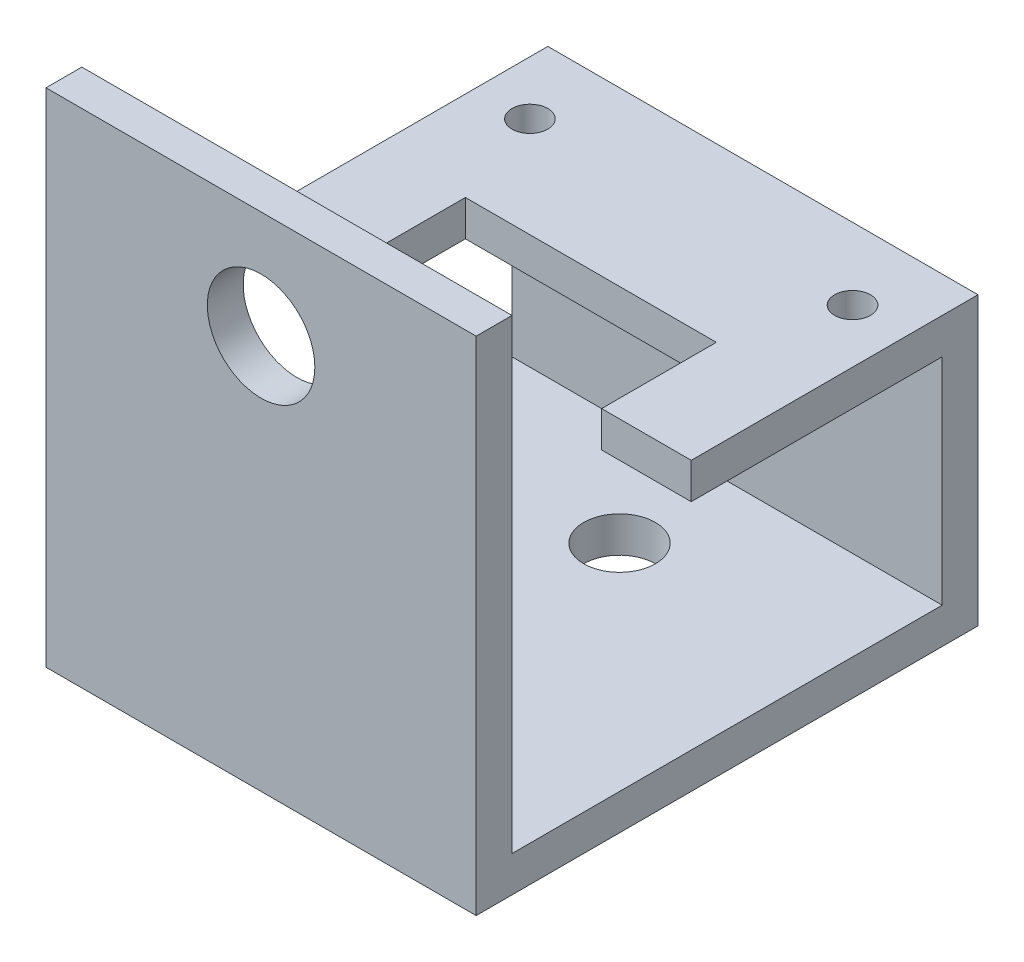
ISO-10303-21;
HEADER;
FILE_DESCRIPTION(('STEP AP214'),'2;1');
FILE_NAME('part.step','',(''),(''),'','','');
FILE_SCHEMA(('AUTOMOTIVE_DESIGN { 1 0 10303 214 1 1 1 1 }'));
ENDSEC;
DATA;
#1=APPLICATION_CONTEXT('core data for automotive mechanical design processes');
#2=APPLICATION_PROTOCOL_DEFINITION('international standard','automotive_design',2000,#1);
#3=PRODUCT_CONTEXT('',#1,'mechanical');
#4=PRODUCT('Part','Part','',(#3));
#5=PRODUCT_RELATED_PRODUCT_CATEGORY('part','',(#4));
#6=PRODUCT_DEFINITION_FORMATION('','',#4);
#7=PRODUCT_DEFINITION_CONTEXT('part definition',#1,'design');
#8=PRODUCT_DEFINITION('design','',#6,#7);
#9=PRODUCT_DEFINITION_SHAPE('','',#8);
#10=(LENGTH_UNIT() NAMED_UNIT(*) SI_UNIT(.MILLI.,.METRE.));
#11=(NAMED_UNIT(*) PLANE_ANGLE_UNIT() SI_UNIT($,.RADIAN.));
#12=(NAMED_UNIT(*) SI_UNIT($,.STERADIAN.) SOLID_ANGLE_UNIT());
#13=UNCERTAINTY_MEASURE_WITH_UNIT(LENGTH_MEASURE(1.E-05),#10,'distance_accuracy_value','');
#14=(GEOMETRIC_REPRESENTATION_CONTEXT(3) GLOBAL_UNCERTAINTY_ASSIGNED_CONTEXT((#13)) GLOBAL_UNIT_ASSIGNED_CONTEXT((#10,
#11,#12)) REPRESENTATION_CONTEXT('',''));
#15=CARTESIAN_POINT('',(0.,0.,0.));
#16=DIRECTION('',(0.,0.,1.));
#17=DIRECTION('',(1.,0.,0.));
#18=AXIS2_PLACEMENT_3D('',#15,#16,#17);
#19=CARTESIAN_POINT('',(38.1,0.,0.));
#20=DIRECTION('',(0.,-1.,0.));
#21=DIRECTION('',(0.,0.,-1.));
#22=AXIS2_PLACEMENT_3D('',#19,#20,#21);
#23=PLANE('',#22);
#24=DIRECTION('',(0.,0.,1.));
#25=VECTOR('',#24,1.);
#26=CARTESIAN_POINT('',(0.,0.,0.));
#27=LINE('',#26,#25);
#28=CARTESIAN_POINT('',(0.,0.,0.));
#29=VERTEX_POINT('',#28);
#30=CARTESIAN_POINT('',(0.,0.,38.1));
#31=VERTEX_POINT('',#30);
#32=EDGE_CURVE('E160',#29,#31,#27,.T.);
#33=ORIENTED_EDGE('',*,*,#32,.T.);
#34=DIRECTION('',(-1.,0.,0.));
#35=VECTOR('',#34,1.);
#36=CARTESIAN_POINT('',(38.1,0.,38.1));
#37=LINE('',#36,#35);
#38=CARTESIAN_POINT('',(38.1,0.,38.1));
#39=VERTEX_POINT('',#38);
#40=EDGE_CURVE('E40',#39,#31,#37,.T.);
#41=ORIENTED_EDGE('',*,*,#40,.F.);
#42=DIRECTION('',(0.,0.,1.));
#43=VECTOR('',#42,1.);
#44=CARTESIAN_POINT('',(38.1,0.,0.));
#45=LINE('',#44,#43);
#46=CARTESIAN_POINT('',(38.1,0.,0.));
#47=VERTEX_POINT('',#46);
#48=EDGE_CURVE('E102',#47,#39,#45,.T.);
#49=ORIENTED_EDGE('',*,*,#48,.F.);
#50=DIRECTION('',(-1.,0.,0.));
#51=VECTOR('',#50,1.);
#52=CARTESIAN_POINT('',(38.1,0.,0.));
#53=LINE('',#52,#51);
#54=EDGE_CURVE('E11',#47,#29,#53,.T.);
#55=ORIENTED_EDGE('',*,*,#54,.T.);
#56=EDGE_LOOP('',(#33,#41,#49,#55));
#57=FACE_BOUND('',#56,.T.);
#58=CARTESIAN_POINT('',(19.05,0.,9.52499999999999));
#59=DIRECTION('',(0.,-1.,0.));
#60=DIRECTION('',(0.,0.,-1.));
#61=AXIS2_PLACEMENT_3D('',#58,#59,#60);
#62=CIRCLE('',#61,3.17499999999999);
#63=CARTESIAN_POINT('',(19.05,0.,6.35));
#64=VERTEX_POINT('',#63);
#65=EDGE_CURVE('E268',#64,#64,#62,.F.);
#66=ORIENTED_EDGE('',*,*,#65,.F.);
#67=EDGE_LOOP('',(#66));
#68=FACE_BOUND('',#67,.T.);
#69=CARTESIAN_POINT('',(19.05,0.,28.575));
#70=DIRECTION('',(0.,-1.,0.));
#71=DIRECTION('',(0.,0.,-1.));
#72=AXIS2_PLACEMENT_3D('',#69,#70,#71);
#73=CIRCLE('',#72,3.17499999999999);
#74=CARTESIAN_POINT('',(19.05,0.,25.4));
#75=VERTEX_POINT('',#74);
#76=EDGE_CURVE('E272',#75,#75,#73,.F.);
#77=ORIENTED_EDGE('',*,*,#76,.F.);
#78=EDGE_LOOP('',(#77));
#79=FACE_BOUND('',#78,.T.);
#80=ADVANCED_FACE('F32',(#57,#68,#79),#23,.F.);
#81=CARTESIAN_POINT('',(38.1,22.225,22.225));
#82=DIRECTION('',(0.,0.,-1.));
#83=DIRECTION('',(0.,1.,0.));
#84=AXIS2_PLACEMENT_3D('',#81,#82,#83);
#85=PLANE('',#84);
#86=DIRECTION('',(-1.,0.,0.));
#87=VECTOR('',#86,1.);
#88=CARTESIAN_POINT('',(38.1,22.225,22.225));
#89=LINE('',#88,#87);
#90=CARTESIAN_POINT('',(38.1,22.225,22.225));
#91=VERTEX_POINT('',#90);
#92=CARTESIAN_POINT('',(30.1625,22.225,22.225));
#93=VERTEX_POINT('',#92);
#94=EDGE_CURVE('E138',#91,#93,#89,.T.);
#95=ORIENTED_EDGE('',*,*,#94,.T.);
#96=DIRECTION('',(0.,1.,0.));
#97=VECTOR('',#96,1.);
#98=CARTESIAN_POINT('',(30.1625,-5.38718938421521,22.225));
#99=LINE('',#98,#97);
#100=CARTESIAN_POINT('',(30.1625,19.05,22.225));
#101=VERTEX_POINT('',#100);
#102=EDGE_CURVE('E238',#101,#93,#99,.T.);
#103=ORIENTED_EDGE('',*,*,#102,.F.);
#104=DIRECTION('',(-1.,0.,0.));
#105=VECTOR('',#104,1.);
#106=CARTESIAN_POINT('',(38.1,19.05,22.225));
#107=LINE('',#106,#105);
#108=CARTESIAN_POINT('',(38.1,19.05,22.225));
#109=VERTEX_POINT('',#108);
#110=EDGE_CURVE('E151',#109,#101,#107,.T.);
#111=ORIENTED_EDGE('',*,*,#110,.F.);
#112=DIRECTION('',(0.,-1.,0.));
#113=VECTOR('',#112,1.);
#114=CARTESIAN_POINT('',(38.1,22.225,22.225));
#115=LINE('',#114,#113);
#116=EDGE_CURVE('E128',#91,#109,#115,.T.);
#117=ORIENTED_EDGE('',*,*,#116,.F.);
#118=EDGE_LOOP('',(#95,#103,#111,#117));
#119=FACE_BOUND('',#118,.T.);
#120=ADVANCED_FACE('F149',(#119),#85,.F.);
#121=CARTESIAN_POINT('',(38.1,19.05,0.));
#122=DIRECTION('',(0.,0.,-1.));
#123=DIRECTION('',(-1.,0.,0.));
#124=AXIS2_PLACEMENT_3D('',#121,#122,#123);
#125=PLANE('',#124);
#126=DIRECTION('',(0.,-1.,0.));
#127=VECTOR('',#126,1.);
#128=CARTESIAN_POINT('',(0.,19.05,0.));
#129=LINE('',#128,#127);
#130=CARTESIAN_POINT('',(0.,19.05,0.));
#131=VERTEX_POINT('',#130);
#132=EDGE_CURVE('E157',#131,#29,#129,.T.);
#133=ORIENTED_EDGE('',*,*,#132,.T.);
#134=ORIENTED_EDGE('',*,*,#54,.F.);
#135=DIRECTION('',(0.,-1.,0.));
#136=VECTOR('',#135,1.);
#137=CARTESIAN_POINT('',(38.1,19.05,0.));
#138=LINE('',#137,#136);
#139=CARTESIAN_POINT('',(38.1,19.05,0.));
#140=VERTEX_POINT('',#139);
#141=EDGE_CURVE('E180',#140,#47,#138,.T.);
#142=ORIENTED_EDGE('',*,*,#141,.F.);
#143=DIRECTION('',(-1.,0.,0.));
#144=VECTOR('',#143,1.);
#145=CARTESIAN_POINT('',(38.1,19.05,0.));
#146=LINE('',#145,#144);
#147=EDGE_CURVE('E153',#140,#131,#146,.T.);
#148=ORIENTED_EDGE('',*,*,#147,.T.);
#149=EDGE_LOOP('',(#133,#134,#142,#148));
#150=FACE_BOUND('',#149,.T.);
#151=ADVANCED_FACE('F34',(#150),#125,.F.);
#152=CARTESIAN_POINT('',(38.1,0.,38.1));
#153=DIRECTION('',(0.,0.,1.));
#154=DIRECTION('',(1.,0.,0.));
#155=AXIS2_PLACEMENT_3D('',#152,#153,#154);
#156=PLANE('',#155);
#157=CARTESIAN_POINT('',(19.05,31.75,38.1));
#158=DIRECTION('',(0.,0.,1.));
#159=DIRECTION('',(1.,0.,0.));
#160=AXIS2_PLACEMENT_3D('',#157,#158,#159);
#161=CIRCLE('',#160,4.7625);
#162=CARTESIAN_POINT('',(23.8125,31.75,38.1));
#163=VERTEX_POINT('',#162);
#164=EDGE_CURVE('E262',#163,#163,#161,.F.);
#165=ORIENTED_EDGE('',*,*,#164,.F.);
#166=EDGE_LOOP('',(#165));
#167=FACE_BOUND('',#166,.T.);
#168=DIRECTION('',(0.,1.,0.));
#169=VECTOR('',#168,1.);
#170=CARTESIAN_POINT('',(0.,0.,38.1));
#171=LINE('',#170,#169);
#172=CARTESIAN_POINT('',(0.,41.275,38.1));
#173=VERTEX_POINT('',#172);
#174=EDGE_CURVE('E163',#31,#173,#171,.T.);
#175=ORIENTED_EDGE('',*,*,#174,.T.);
#176=DIRECTION('',(-1.,0.,0.));
#177=VECTOR('',#176,1.);
#178=CARTESIAN_POINT('',(38.1,41.275,38.1));
#179=LINE('',#178,#177);
#180=CARTESIAN_POINT('',(38.1,41.275,38.1));
#181=VERTEX_POINT('',#180);
#182=EDGE_CURVE('E194',#181,#173,#179,.T.);
#183=ORIENTED_EDGE('',*,*,#182,.F.);
#184=DIRECTION('',(0.,1.,0.));
#185=VECTOR('',#184,1.);
#186=CARTESIAN_POINT('',(38.1,0.,38.1));
#187=LINE('',#186,#185);
#188=EDGE_CURVE('E202',#39,#181,#187,.T.);
#189=ORIENTED_EDGE('',*,*,#188,.F.);
#190=ORIENTED_EDGE('',*,*,#40,.T.);
#191=EDGE_LOOP('',(#175,#183,#189,#190));
#192=FACE_BOUND('',#191,.T.);
#193=ADVANCED_FACE('F200',(#167,#192),#156,.F.);
#194=CARTESIAN_POINT('',(38.1,41.275,41.275));
#195=DIRECTION('',(0.,-1.,0.));
#196=DIRECTION('',(0.,0.,-1.));
#197=AXIS2_PLACEMENT_3D('',#194,#195,#196);
#198=PLANE('',#197);
#199=DIRECTION('',(0.,0.,1.));
#200=VECTOR('',#199,1.);
#201=CARTESIAN_POINT('',(0.,41.275,41.275));
#202=LINE('',#201,#200);
#203=CARTESIAN_POINT('',(0.,41.275,41.275));
#204=VERTEX_POINT('',#203);
#205=EDGE_CURVE('E165',#173,#204,#202,.T.);
#206=ORIENTED_EDGE('',*,*,#205,.T.);
#207=DIRECTION('',(-1.,0.,0.));
#208=VECTOR('',#207,1.);
#209=CARTESIAN_POINT('',(38.1,41.275,41.275));
#210=LINE('',#209,#208);
#211=CARTESIAN_POINT('',(38.1,41.275,41.275));
#212=VERTEX_POINT('',#211);
#213=EDGE_CURVE('E191',#212,#204,#210,.T.);
#214=ORIENTED_EDGE('',*,*,#213,.F.);
#215=DIRECTION('',(0.,0.,1.));
#216=VECTOR('',#215,1.);
#217=CARTESIAN_POINT('',(38.1,41.275,41.275));
#218=LINE('',#217,#216);
#219=EDGE_CURVE('E220',#181,#212,#218,.T.);
#220=ORIENTED_EDGE('',*,*,#219,.F.);
#221=ORIENTED_EDGE('',*,*,#182,.T.);
#222=EDGE_LOOP('',(#206,#214,#220,#221));
#223=FACE_BOUND('',#222,.T.);
#224=ADVANCED_FACE('F211',(#223),#198,.F.);
#225=CARTESIAN_POINT('',(38.1,41.275,41.275));
#226=DIRECTION('',(0.,0.,-1.));
#227=DIRECTION('',(-1.,0.,0.));
#228=AXIS2_PLACEMENT_3D('',#225,#226,#227);
#229=PLANE('',#228);
#230=CARTESIAN_POINT('',(19.05,31.75,41.275));
#231=DIRECTION('',(0.,0.,1.));
#232=DIRECTION('',(1.,0.,0.));
#233=AXIS2_PLACEMENT_3D('',#230,#231,#232);
#234=CIRCLE('',#233,4.7625);
#235=CARTESIAN_POINT('',(23.8125,31.75,41.275));
#236=VERTEX_POINT('',#235);
#237=EDGE_CURVE('E265',#236,#236,#234,.T.);
#238=ORIENTED_EDGE('',*,*,#237,.F.);
#239=EDGE_LOOP('',(#238));
#240=FACE_BOUND('',#239,.T.);
#241=DIRECTION('',(0.,-1.,0.));
#242=VECTOR('',#241,1.);
#243=CARTESIAN_POINT('',(0.,41.275,41.275));
#244=LINE('',#243,#242);
#245=CARTESIAN_POINT('',(0.,-3.17500000000001,41.275));
#246=VERTEX_POINT('',#245);
#247=EDGE_CURVE('E167',#204,#246,#244,.T.);
#248=ORIENTED_EDGE('',*,*,#247,.T.);
#249=DIRECTION('',(-1.,0.,0.));
#250=VECTOR('',#249,1.);
#251=CARTESIAN_POINT('',(38.1,-3.17500000000001,41.275));
#252=LINE('',#251,#250);
#253=CARTESIAN_POINT('',(38.1,-3.17500000000001,41.275));
#254=VERTEX_POINT('',#253);
#255=EDGE_CURVE('E188',#254,#246,#252,.T.);
#256=ORIENTED_EDGE('',*,*,#255,.F.);
#257=DIRECTION('',(0.,-1.,0.));
#258=VECTOR('',#257,1.);
#259=CARTESIAN_POINT('',(38.1,41.275,41.275));
#260=LINE('',#259,#258);
#261=EDGE_CURVE('E217',#212,#254,#260,.T.);
#262=ORIENTED_EDGE('',*,*,#261,.F.);
#263=ORIENTED_EDGE('',*,*,#213,.T.);
#264=EDGE_LOOP('',(#248,#256,#262,#263));
#265=FACE_BOUND('',#264,.T.);
#266=ADVANCED_FACE('F215',(#240,#265),#229,.F.);
#267=CARTESIAN_POINT('',(38.1,-3.17500000000001,41.275));
#268=DIRECTION('',(0.,1.,0.));
#269=DIRECTION('',(0.,0.,1.));
#270=AXIS2_PLACEMENT_3D('',#267,#268,#269);
#271=PLANE('',#270);
#272=CARTESIAN_POINT('',(19.05,-3.17500000000001,28.575));
#273=DIRECTION('',(0.,-1.,0.));
#274=DIRECTION('',(0.,0.,-1.));
#275=AXIS2_PLACEMENT_3D('',#272,#273,#274);
#276=CIRCLE('',#275,3.17499999999999);
#277=CARTESIAN_POINT('',(19.05,-3.17500000000001,25.4));
#278=VERTEX_POINT('',#277);
#279=EDGE_CURVE('E275',#278,#278,#276,.T.);
#280=ORIENTED_EDGE('',*,*,#279,.F.);
#281=EDGE_LOOP('',(#280));
#282=FACE_BOUND('',#281,.T.);
#283=CARTESIAN_POINT('',(19.05,-3.17500000000001,9.52499999999999));
#284=DIRECTION('',(0.,-1.,0.));
#285=DIRECTION('',(0.,0.,-1.));
#286=AXIS2_PLACEMENT_3D('',#283,#284,#285);
#287=CIRCLE('',#286,3.17499999999999);
#288=CARTESIAN_POINT('',(19.05,-3.17500000000001,6.35));
#289=VERTEX_POINT('',#288);
#290=EDGE_CURVE('E269',#289,#289,#287,.T.);
#291=ORIENTED_EDGE('',*,*,#290,.F.);
#292=EDGE_LOOP('',(#291));
#293=FACE_BOUND('',#292,.T.);
#294=DIRECTION('',(0.,0.,-1.));
#295=VECTOR('',#294,1.);
#296=CARTESIAN_POINT('',(0.,-3.17500000000001,41.275));
#297=LINE('',#296,#295);
#298=CARTESIAN_POINT('',(0.,-3.175,-3.175));
#299=VERTEX_POINT('',#298);
#300=EDGE_CURVE('E169',#246,#299,#297,.T.);
#301=ORIENTED_EDGE('',*,*,#300,.T.);
#302=DIRECTION('',(-1.,0.,0.));
#303=VECTOR('',#302,1.);
#304=CARTESIAN_POINT('',(38.1,-3.175,-3.175));
#305=LINE('',#304,#303);
#306=CARTESIAN_POINT('',(38.1,-3.175,-3.175));
#307=VERTEX_POINT('',#306);
#308=EDGE_CURVE('E185',#307,#299,#305,.T.);
#309=ORIENTED_EDGE('',*,*,#308,.F.);
#310=DIRECTION('',(0.,0.,-1.));
#311=VECTOR('',#310,1.);
#312=CARTESIAN_POINT('',(38.1,-3.17500000000001,41.275));
#313=LINE('',#312,#311);
#314=EDGE_CURVE('E219',#254,#307,#313,.T.);
#315=ORIENTED_EDGE('',*,*,#314,.F.);
#316=ORIENTED_EDGE('',*,*,#255,.T.);
#317=EDGE_LOOP('',(#301,#309,#315,#316));
#318=FACE_BOUND('',#317,.T.);
#319=ADVANCED_FACE('F299',(#282,#293,#318),#271,.F.);
#320=CARTESIAN_POINT('',(38.1,-3.175,-3.175));
#321=DIRECTION('',(0.,0.,1.));
#322=DIRECTION('',(0.,-1.,0.));
#323=AXIS2_PLACEMENT_3D('',#320,#321,#322);
#324=PLANE('',#323);
#325=DIRECTION('',(0.,1.,0.));
#326=VECTOR('',#325,1.);
#327=CARTESIAN_POINT('',(0.,-3.175,-3.175));
#328=LINE('',#327,#326);
#329=CARTESIAN_POINT('',(0.,22.225,-3.175));
#330=VERTEX_POINT('',#329);
#331=EDGE_CURVE('E171',#299,#330,#328,.T.);
#332=ORIENTED_EDGE('',*,*,#331,.T.);
#333=DIRECTION('',(-1.,0.,0.));
#334=VECTOR('',#333,1.);
#335=CARTESIAN_POINT('',(38.1,22.225,-3.175));
#336=LINE('',#335,#334);
#337=CARTESIAN_POINT('',(38.1,22.225,-3.175));
#338=VERTEX_POINT('',#337);
#339=EDGE_CURVE('E146',#338,#330,#336,.T.);
#340=ORIENTED_EDGE('',*,*,#339,.F.);
#341=DIRECTION('',(0.,1.,0.));
#342=VECTOR('',#341,1.);
#343=CARTESIAN_POINT('',(38.1,-3.175,-3.175));
#344=LINE('',#343,#342);
#345=EDGE_CURVE('E131',#307,#338,#344,.T.);
#346=ORIENTED_EDGE('',*,*,#345,.F.);
#347=ORIENTED_EDGE('',*,*,#308,.T.);
#348=EDGE_LOOP('',(#332,#340,#346,#347));
#349=FACE_BOUND('',#348,.T.);
#350=ADVANCED_FACE('F303',(#349),#324,.F.);
#351=CARTESIAN_POINT('',(38.1,22.225,-3.175));
#352=DIRECTION('',(0.,-1.,0.));
#353=DIRECTION('',(0.,0.,-1.));
#354=AXIS2_PLACEMENT_3D('',#351,#352,#353);
#355=PLANE('',#354);
#356=CARTESIAN_POINT('',(4.7625,22.225,3.17499999999999));
#357=DIRECTION('',(0.,1.,0.));
#358=DIRECTION('',(0.,0.,1.));
#359=AXIS2_PLACEMENT_3D('',#356,#357,#358);
#360=CIRCLE('',#359,1.5875);
#361=CARTESIAN_POINT('',(4.7625,22.225,4.76249999999999));
#362=VERTEX_POINT('',#361);
#363=EDGE_CURVE('E259',#362,#362,#360,.T.);
#364=ORIENTED_EDGE('',*,*,#363,.F.);
#365=EDGE_LOOP('',(#364));
#366=FACE_BOUND('',#365,.T.);
#367=CARTESIAN_POINT('',(33.3375,22.225,3.17499999999999));
#368=DIRECTION('',(0.,1.,0.));
#369=DIRECTION('',(0.,0.,1.));
#370=AXIS2_PLACEMENT_3D('',#367,#368,#369);
#371=CIRCLE('',#370,1.5875);
#372=CARTESIAN_POINT('',(33.3375,22.225,4.76249999999999));
#373=VERTEX_POINT('',#372);
#374=EDGE_CURVE('E253',#373,#373,#371,.T.);
#375=ORIENTED_EDGE('',*,*,#374,.F.);
#376=EDGE_LOOP('',(#375));
#377=FACE_BOUND('',#376,.T.);
#378=DIRECTION('',(-1.,0.,0.));
#379=VECTOR('',#378,1.);
#380=CARTESIAN_POINT('',(30.1625,22.225,12.065));
#381=LINE('',#380,#379);
#382=CARTESIAN_POINT('',(30.1625,22.225,12.065));
#383=VERTEX_POINT('',#382);
#384=CARTESIAN_POINT('',(7.9375,22.225,12.065));
#385=VERTEX_POINT('',#384);
#386=EDGE_CURVE('E244',#383,#385,#381,.T.);
#387=ORIENTED_EDGE('',*,*,#386,.F.);
#388=DIRECTION('',(0.,0.,-1.));
#389=VECTOR('',#388,1.);
#390=CARTESIAN_POINT('',(30.1625,22.225,22.225));
#391=LINE('',#390,#389);
#392=EDGE_CURVE('E143',#93,#383,#391,.T.);
#393=ORIENTED_EDGE('',*,*,#392,.F.);
#394=ORIENTED_EDGE('',*,*,#94,.F.);
#395=DIRECTION('',(0.,0.,1.));
#396=VECTOR('',#395,1.);
#397=CARTESIAN_POINT('',(38.1,22.225,-3.175));
#398=LINE('',#397,#396);
#399=EDGE_CURVE('E124',#338,#91,#398,.T.);
#400=ORIENTED_EDGE('',*,*,#399,.F.);
#401=ORIENTED_EDGE('',*,*,#339,.T.);
#402=DIRECTION('',(0.,0.,1.));
#403=VECTOR('',#402,1.);
#404=CARTESIAN_POINT('',(0.,22.225,-3.175));
#405=LINE('',#404,#403);
#406=CARTESIAN_POINT('',(0.,22.225,22.225));
#407=VERTEX_POINT('',#406);
#408=EDGE_CURVE('E173',#330,#407,#405,.T.);
#409=ORIENTED_EDGE('',*,*,#408,.T.);
#410=CARTESIAN_POINT('',(7.9375,22.225,22.225));
#411=VERTEX_POINT('',#410);
#412=EDGE_CURVE('E147',#411,#407,#89,.T.);
#413=ORIENTED_EDGE('',*,*,#412,.F.);
#414=DIRECTION('',(0.,0.,1.));
#415=VECTOR('',#414,1.);
#416=CARTESIAN_POINT('',(7.9375,22.225,22.225));
#417=LINE('',#416,#415);
#418=EDGE_CURVE('E233',#385,#411,#417,.T.);
#419=ORIENTED_EDGE('',*,*,#418,.F.);
#420=EDGE_LOOP('',(#387,#393,#394,#400,#401,#409,#413,#419));
#421=FACE_BOUND('',#420,.T.);
#422=ADVANCED_FACE('F140',(#366,#377,#421),#355,.F.);
#423=CARTESIAN_POINT('',(7.9375,19.05,22.225));
#424=VERTEX_POINT('',#423);
#425=CARTESIAN_POINT('',(0.,19.05,22.225));
#426=VERTEX_POINT('',#425);
#427=EDGE_CURVE('E182',#424,#426,#107,.T.);
#428=ORIENTED_EDGE('',*,*,#427,.F.);
#429=DIRECTION('',(0.,1.,0.));
#430=VECTOR('',#429,1.);
#431=CARTESIAN_POINT('',(7.9375,-5.38718938421521,22.225));
#432=LINE('',#431,#430);
#433=EDGE_CURVE('E235',#424,#411,#432,.T.);
#434=ORIENTED_EDGE('',*,*,#433,.T.);
#435=ORIENTED_EDGE('',*,*,#412,.T.);
#436=DIRECTION('',(0.,-1.,0.));
#437=VECTOR('',#436,1.);
#438=CARTESIAN_POINT('',(0.,22.225,22.225));
#439=LINE('',#438,#437);
#440=EDGE_CURVE('E176',#407,#426,#439,.T.);
#441=ORIENTED_EDGE('',*,*,#440,.T.);
#442=EDGE_LOOP('',(#428,#434,#435,#441));
#443=FACE_BOUND('',#442,.T.);
#444=ADVANCED_FACE('F289',(#443),#85,.F.);
#445=CARTESIAN_POINT('',(38.1,19.05,22.225));
#446=DIRECTION('',(0.,1.,0.));
#447=DIRECTION('',(0.,0.,1.));
#448=AXIS2_PLACEMENT_3D('',#445,#446,#447);
#449=PLANE('',#448);
#450=CARTESIAN_POINT('',(4.7625,19.05,3.17499999999999));
#451=DIRECTION('',(0.,1.,0.));
#452=DIRECTION('',(0.,0.,1.));
#453=AXIS2_PLACEMENT_3D('',#450,#451,#452);
#454=CIRCLE('',#453,1.5875);
#455=CARTESIAN_POINT('',(4.7625,19.05,4.76249999999999));
#456=VERTEX_POINT('',#455);
#457=EDGE_CURVE('E256',#456,#456,#454,.F.);
#458=ORIENTED_EDGE('',*,*,#457,.F.);
#459=EDGE_LOOP('',(#458));
#460=FACE_BOUND('',#459,.T.);
#461=CARTESIAN_POINT('',(33.3375,19.05,3.17499999999999));
#462=DIRECTION('',(0.,1.,0.));
#463=DIRECTION('',(0.,0.,1.));
#464=AXIS2_PLACEMENT_3D('',#461,#462,#463);
#465=CIRCLE('',#464,1.5875);
#466=CARTESIAN_POINT('',(33.3375,19.05,4.76249999999999));
#467=VERTEX_POINT('',#466);
#468=EDGE_CURVE('E247',#467,#467,#465,.F.);
#469=ORIENTED_EDGE('',*,*,#468,.F.);
#470=EDGE_LOOP('',(#469));
#471=FACE_BOUND('',#470,.T.);
#472=ORIENTED_EDGE('',*,*,#110,.T.);
#473=DIRECTION('',(0.,0.,1.));
#474=VECTOR('',#473,1.);
#475=CARTESIAN_POINT('',(30.1625,19.05,22.225));
#476=LINE('',#475,#474);
#477=CARTESIAN_POINT('',(30.1625,19.05,12.065));
#478=VERTEX_POINT('',#477);
#479=EDGE_CURVE('E229',#478,#101,#476,.T.);
#480=ORIENTED_EDGE('',*,*,#479,.F.);
#481=DIRECTION('',(1.,0.,0.));
#482=VECTOR('',#481,1.);
#483=CARTESIAN_POINT('',(30.1625,19.05,12.065));
#484=LINE('',#483,#482);
#485=CARTESIAN_POINT('',(7.9375,19.05,12.065));
#486=VERTEX_POINT('',#485);
#487=EDGE_CURVE('E161',#486,#478,#484,.T.);
#488=ORIENTED_EDGE('',*,*,#487,.F.);
#489=DIRECTION('',(0.,0.,-1.));
#490=VECTOR('',#489,1.);
#491=CARTESIAN_POINT('',(7.9375,19.05,22.225));
#492=LINE('',#491,#490);
#493=EDGE_CURVE('E241',#424,#486,#492,.T.);
#494=ORIENTED_EDGE('',*,*,#493,.F.);
#495=ORIENTED_EDGE('',*,*,#427,.T.);
#496=DIRECTION('',(0.,0.,-1.));
#497=VECTOR('',#496,1.);
#498=CARTESIAN_POINT('',(0.,19.05,22.225));
#499=LINE('',#498,#497);
#500=EDGE_CURVE('E94',#426,#131,#499,.T.);
#501=ORIENTED_EDGE('',*,*,#500,.T.);
#502=ORIENTED_EDGE('',*,*,#147,.F.);
#503=DIRECTION('',(0.,0.,-1.));
#504=VECTOR('',#503,1.);
#505=CARTESIAN_POINT('',(38.1,19.05,22.225));
#506=LINE('',#505,#504);
#507=EDGE_CURVE('E56',#109,#140,#506,.T.);
#508=ORIENTED_EDGE('',*,*,#507,.F.);
#509=EDGE_LOOP('',(#472,#480,#488,#494,#495,#501,#502,#508));
#510=FACE_BOUND('',#509,.T.);
#511=ADVANCED_FACE('F312',(#460,#471,#510),#449,.F.);
#512=CARTESIAN_POINT('',(38.1,0.,0.));
#513=DIRECTION('',(-1.,0.,0.));
#514=DIRECTION('',(0.,0.,1.));
#515=AXIS2_PLACEMENT_3D('',#512,#513,#514);
#516=PLANE('',#515);
#517=ORIENTED_EDGE('',*,*,#141,.T.);
#518=ORIENTED_EDGE('',*,*,#48,.T.);
#519=ORIENTED_EDGE('',*,*,#188,.T.);
#520=ORIENTED_EDGE('',*,*,#219,.T.);
#521=ORIENTED_EDGE('',*,*,#261,.T.);
#522=ORIENTED_EDGE('',*,*,#314,.T.);
#523=ORIENTED_EDGE('',*,*,#345,.T.);
#524=ORIENTED_EDGE('',*,*,#399,.T.);
#525=ORIENTED_EDGE('',*,*,#116,.T.);
#526=ORIENTED_EDGE('',*,*,#507,.T.);
#527=EDGE_LOOP('',(#517,#518,#519,#520,#521,#522,#523,#524,#525,#526));
#528=FACE_BOUND('',#527,.T.);
#529=ADVANCED_FACE('F126',(#528),#516,.F.);
#530=CARTESIAN_POINT('',(0.,0.,0.));
#531=DIRECTION('',(-1.,0.,0.));
#532=DIRECTION('',(0.,0.,1.));
#533=AXIS2_PLACEMENT_3D('',#530,#531,#532);
#534=PLANE('',#533);
#535=ORIENTED_EDGE('',*,*,#132,.F.);
#536=ORIENTED_EDGE('',*,*,#500,.F.);
#537=ORIENTED_EDGE('',*,*,#440,.F.);
#538=ORIENTED_EDGE('',*,*,#408,.F.);
#539=ORIENTED_EDGE('',*,*,#331,.F.);
#540=ORIENTED_EDGE('',*,*,#300,.F.);
#541=ORIENTED_EDGE('',*,*,#247,.F.);
#542=ORIENTED_EDGE('',*,*,#205,.F.);
#543=ORIENTED_EDGE('',*,*,#174,.F.);
#544=ORIENTED_EDGE('',*,*,#32,.F.);
#545=EDGE_LOOP('',(#535,#536,#537,#538,#539,#540,#541,#542,#543,#544));
#546=FACE_BOUND('',#545,.T.);
#547=ADVANCED_FACE('F206',(#546),#534,.T.);
#548=CARTESIAN_POINT('',(30.1625,-5.38718938421521,22.225));
#549=DIRECTION('',(1.,0.,0.));
#550=DIRECTION('',(0.,0.,-1.));
#551=AXIS2_PLACEMENT_3D('',#548,#549,#550);
#552=PLANE('',#551);
#553=ORIENTED_EDGE('',*,*,#479,.T.);
#554=ORIENTED_EDGE('',*,*,#102,.T.);
#555=ORIENTED_EDGE('',*,*,#392,.T.);
#556=DIRECTION('',(0.,1.,0.));
#557=VECTOR('',#556,1.);
#558=CARTESIAN_POINT('',(30.1625,-5.38718938421521,12.065));
#559=LINE('',#558,#557);
#560=EDGE_CURVE('E230',#478,#383,#559,.T.);
#561=ORIENTED_EDGE('',*,*,#560,.F.);
#562=EDGE_LOOP('',(#553,#554,#555,#561));
#563=FACE_BOUND('',#562,.T.);
#564=ADVANCED_FACE('F319',(#563),#552,.F.);
#565=CARTESIAN_POINT('',(7.9375,-5.38718938421521,22.225));
#566=DIRECTION('',(-1.,0.,0.));
#567=DIRECTION('',(0.,0.,1.));
#568=AXIS2_PLACEMENT_3D('',#565,#566,#567);
#569=PLANE('',#568);
#570=ORIENTED_EDGE('',*,*,#493,.T.);
#571=DIRECTION('',(0.,1.,0.));
#572=VECTOR('',#571,1.);
#573=CARTESIAN_POINT('',(7.9375,-5.38718938421521,12.065));
#574=LINE('',#573,#572);
#575=EDGE_CURVE('E47',#486,#385,#574,.T.);
#576=ORIENTED_EDGE('',*,*,#575,.T.);
#577=ORIENTED_EDGE('',*,*,#418,.T.);
#578=ORIENTED_EDGE('',*,*,#433,.F.);
#579=EDGE_LOOP('',(#570,#576,#577,#578));
#580=FACE_BOUND('',#579,.T.);
#581=ADVANCED_FACE('F324',(#580),#569,.F.);
#582=CARTESIAN_POINT('',(30.1625,-5.38718938421521,12.065));
#583=DIRECTION('',(0.,0.,-1.));
#584=DIRECTION('',(-1.,0.,0.));
#585=AXIS2_PLACEMENT_3D('',#582,#583,#584);
#586=PLANE('',#585);
#587=ORIENTED_EDGE('',*,*,#487,.T.);
#588=ORIENTED_EDGE('',*,*,#560,.T.);
#589=ORIENTED_EDGE('',*,*,#386,.T.);
#590=ORIENTED_EDGE('',*,*,#575,.F.);
#591=EDGE_LOOP('',(#587,#588,#589,#590));
#592=FACE_BOUND('',#591,.T.);
#593=ADVANCED_FACE('F326',(#592),#586,.F.);
#594=CARTESIAN_POINT('',(33.3375,14.5598719394654,3.17499999999999));
#595=DIRECTION('',(0.,1.,0.));
#596=DIRECTION('',(0.,0.,1.));
#597=AXIS2_PLACEMENT_3D('',#594,#595,#596);
#598=CYLINDRICAL_SURFACE('',#597,1.5875);
#599=ORIENTED_EDGE('',*,*,#468,.T.);
#600=EDGE_LOOP('',(#599));
#601=FACE_BOUND('',#600,.T.);
#602=ORIENTED_EDGE('',*,*,#374,.T.);
#603=EDGE_LOOP('',(#602));
#604=FACE_BOUND('',#603,.T.);
#605=ADVANCED_FACE('F329',(#601,#604),#598,.F.);
#606=CARTESIAN_POINT('',(4.7625,14.5598719394654,3.17499999999999));
#607=DIRECTION('',(0.,1.,0.));
#608=DIRECTION('',(0.,0.,1.));
#609=AXIS2_PLACEMENT_3D('',#606,#607,#608);
#610=CYLINDRICAL_SURFACE('',#609,1.5875);
#611=ORIENTED_EDGE('',*,*,#457,.T.);
#612=EDGE_LOOP('',(#611));
#613=FACE_BOUND('',#612,.T.);
#614=ORIENTED_EDGE('',*,*,#363,.T.);
#615=EDGE_LOOP('',(#614));
#616=FACE_BOUND('',#615,.T.);
#617=ADVANCED_FACE('F335',(#613,#616),#610,.F.);
#618=CARTESIAN_POINT('',(19.05,31.75,24.6296158183963));
#619=DIRECTION('',(0.,0.,1.));
#620=DIRECTION('',(1.,0.,0.));
#621=AXIS2_PLACEMENT_3D('',#618,#619,#620);
#622=CYLINDRICAL_SURFACE('',#621,4.7625);
#623=ORIENTED_EDGE('',*,*,#164,.T.);
#624=EDGE_LOOP('',(#623));
#625=FACE_BOUND('',#624,.T.);
#626=ORIENTED_EDGE('',*,*,#237,.T.);
#627=EDGE_LOOP('',(#626));
#628=FACE_BOUND('',#627,.T.);
#629=ADVANCED_FACE('F339',(#625,#628),#622,.F.);
#630=CARTESIAN_POINT('',(19.05,-3.175,9.52499999999999));
#631=DIRECTION('',(0.,-1.,0.));
#632=DIRECTION('',(0.,0.,-1.));
#633=AXIS2_PLACEMENT_3D('',#630,#631,#632);
#634=CYLINDRICAL_SURFACE('',#633,3.17499999999999);
#635=ORIENTED_EDGE('',*,*,#65,.T.);
#636=EDGE_LOOP('',(#635));
#637=FACE_BOUND('',#636,.T.);
#638=ORIENTED_EDGE('',*,*,#290,.T.);
#639=EDGE_LOOP('',(#638));
#640=FACE_BOUND('',#639,.T.);
#641=ADVANCED_FACE('F343',(#637,#640),#634,.F.);
#642=CARTESIAN_POINT('',(19.05,-3.175,28.575));
#643=DIRECTION('',(0.,-1.,0.));
#644=DIRECTION('',(0.,0.,-1.));
#645=AXIS2_PLACEMENT_3D('',#642,#643,#644);
#646=CYLINDRICAL_SURFACE('',#645,3.17499999999999);
#647=ORIENTED_EDGE('',*,*,#76,.T.);
#648=EDGE_LOOP('',(#647));
#649=FACE_BOUND('',#648,.T.);
#650=ORIENTED_EDGE('',*,*,#279,.T.);
#651=EDGE_LOOP('',(#650));
#652=FACE_BOUND('',#651,.T.);
#653=ADVANCED_FACE('F281',(#649,#652),#646,.F.);
#654=CLOSED_SHELL('',(#80,#120,#151,#193,#224,#266,#319,#350,#422,#444,#511,#529,#547,#564,#581,
#593,#605,#617,#629,#641,#653));
#655=MANIFOLD_SOLID_BREP('B2',#654);
#656=ADVANCED_BREP_SHAPE_REPRESENTATION('',(#18,#655),#14);
#657=SHAPE_DEFINITION_REPRESENTATION(#9,#656);
ENDSEC;
END-ISO-10303-21;
